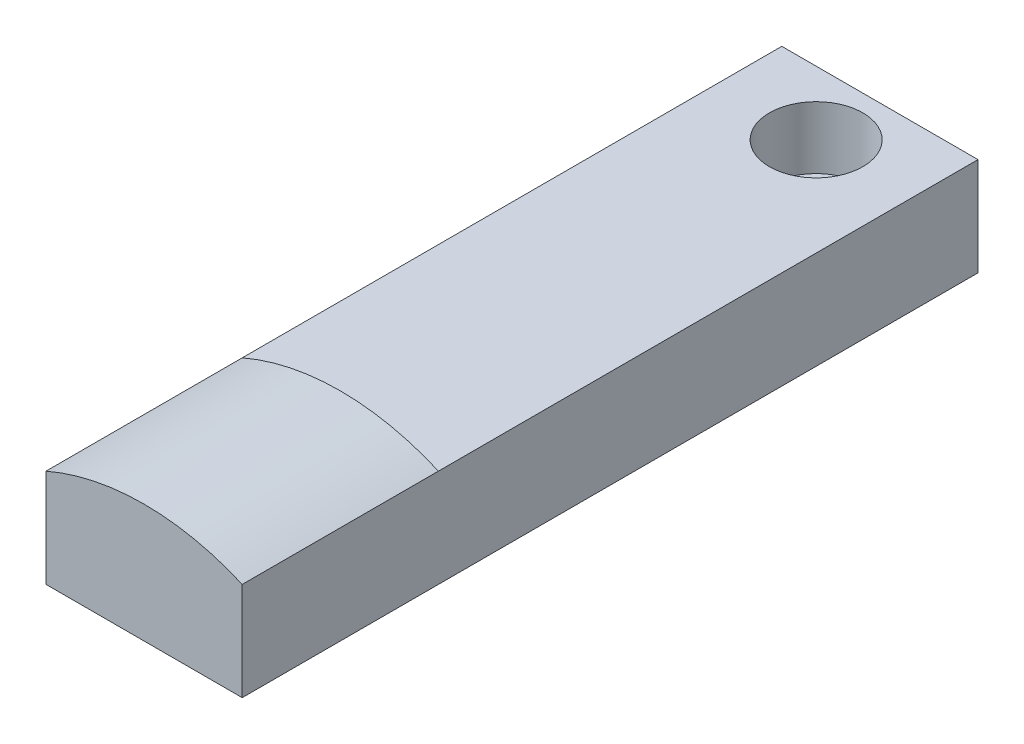
ISO-10303-21;
HEADER;
FILE_DESCRIPTION(('STEP AP214'),'2;1');
FILE_NAME('part.step','',(''),(''),'','','');
FILE_SCHEMA(('AUTOMOTIVE_DESIGN { 1 0 10303 214 1 1 1 1 }'));
ENDSEC;
DATA;
#1=APPLICATION_CONTEXT('core data for automotive mechanical design processes');
#2=APPLICATION_PROTOCOL_DEFINITION('international standard','automotive_design',2000,#1);
#3=PRODUCT_CONTEXT('',#1,'mechanical');
#4=PRODUCT('Part','Part','',(#3));
#5=PRODUCT_RELATED_PRODUCT_CATEGORY('part','',(#4));
#6=PRODUCT_DEFINITION_FORMATION('','',#4);
#7=PRODUCT_DEFINITION_CONTEXT('part definition',#1,'design');
#8=PRODUCT_DEFINITION('design','',#6,#7);
#9=PRODUCT_DEFINITION_SHAPE('','',#8);
#10=(LENGTH_UNIT() NAMED_UNIT(*) SI_UNIT(.MILLI.,.METRE.));
#11=(NAMED_UNIT(*) PLANE_ANGLE_UNIT() SI_UNIT($,.RADIAN.));
#12=(NAMED_UNIT(*) SI_UNIT($,.STERADIAN.) SOLID_ANGLE_UNIT());
#13=UNCERTAINTY_MEASURE_WITH_UNIT(LENGTH_MEASURE(1.E-05),#10,'distance_accuracy_value','');
#14=(GEOMETRIC_REPRESENTATION_CONTEXT(3) GLOBAL_UNCERTAINTY_ASSIGNED_CONTEXT((#13)) GLOBAL_UNIT_ASSIGNED_CONTEXT((#10,
#11,#12)) REPRESENTATION_CONTEXT('',''));
#15=CARTESIAN_POINT('',(0.,0.,0.));
#16=DIRECTION('',(0.,0.,1.));
#17=DIRECTION('',(1.,0.,0.));
#18=AXIS2_PLACEMENT_3D('',#15,#16,#17);
#19=CARTESIAN_POINT('',(10.,5.,75.));
#20=DIRECTION('',(0.,-1.,0.));
#21=DIRECTION('',(1.,0.,0.));
#22=AXIS2_PLACEMENT_3D('',#19,#20,#21);
#23=PLANE('',#22);
#24=CARTESIAN_POINT('',(0.,5.,6.5));
#25=DIRECTION('',(0.,1.,0.));
#26=DIRECTION('',(0.,0.,1.));
#27=AXIS2_PLACEMENT_3D('',#24,#25,#26);
#28=CIRCLE('',#27,4.76000000000001);
#29=CARTESIAN_POINT('',(0.,5.,11.26));
#30=VERTEX_POINT('',#29);
#31=EDGE_CURVE('E102',#30,#30,#28,.T.);
#32=ORIENTED_EDGE('',*,*,#31,.F.);
#33=EDGE_LOOP('',(#32));
#34=FACE_BOUND('',#33,.T.);
#35=DIRECTION('',(1.,0.,0.));
#36=VECTOR('',#35,1.);
#37=CARTESIAN_POINT('',(-10.,5.,55.));
#38=LINE('',#37,#36);
#39=CARTESIAN_POINT('',(-10.,5.,55.));
#40=VERTEX_POINT('',#39);
#41=CARTESIAN_POINT('',(10.,5.,55.));
#42=VERTEX_POINT('',#41);
#43=EDGE_CURVE('E99',#40,#42,#38,.T.);
#44=ORIENTED_EDGE('',*,*,#43,.T.);
#45=DIRECTION('',(0.,0.,-1.));
#46=VECTOR('',#45,1.);
#47=CARTESIAN_POINT('',(10.,5.,75.));
#48=LINE('',#47,#46);
#49=CARTESIAN_POINT('',(10.,5.,0.));
#50=VERTEX_POINT('',#49);
#51=EDGE_CURVE('E70',#42,#50,#48,.T.);
#52=ORIENTED_EDGE('',*,*,#51,.T.);
#53=DIRECTION('',(-1.,0.,0.));
#54=VECTOR('',#53,1.);
#55=CARTESIAN_POINT('',(10.,5.,0.));
#56=LINE('',#55,#54);
#57=CARTESIAN_POINT('',(-10.,5.,0.));
#58=VERTEX_POINT('',#57);
#59=EDGE_CURVE('E105',#50,#58,#56,.T.);
#60=ORIENTED_EDGE('',*,*,#59,.T.);
#61=DIRECTION('',(0.,0.,-1.));
#62=VECTOR('',#61,1.);
#63=CARTESIAN_POINT('',(-10.,5.,75.));
#64=LINE('',#63,#62);
#65=EDGE_CURVE('E77',#40,#58,#64,.T.);
#66=ORIENTED_EDGE('',*,*,#65,.F.);
#67=EDGE_LOOP('',(#44,#52,#60,#66));
#68=FACE_BOUND('',#67,.T.);
#69=ADVANCED_FACE('F33',(#34,#68),#23,.F.);
#70=CARTESIAN_POINT('',(-10.,-5.,75.));
#71=DIRECTION('',(1.,0.,0.));
#72=DIRECTION('',(0.,0.,-1.));
#73=AXIS2_PLACEMENT_3D('',#70,#71,#72);
#74=PLANE('',#73);
#75=DIRECTION('',(0.,-1.,0.));
#76=VECTOR('',#75,1.);
#77=CARTESIAN_POINT('',(-10.,-5.,0.));
#78=LINE('',#77,#76);
#79=CARTESIAN_POINT('',(-10.,-5.,0.));
#80=VERTEX_POINT('',#79);
#81=EDGE_CURVE('E124',#58,#80,#78,.T.);
#82=ORIENTED_EDGE('',*,*,#81,.T.);
#83=DIRECTION('',(0.,0.,-1.));
#84=VECTOR('',#83,1.);
#85=CARTESIAN_POINT('',(-10.,-5.,75.));
#86=LINE('',#85,#84);
#87=CARTESIAN_POINT('',(-10.,-5.,75.));
#88=VERTEX_POINT('',#87);
#89=EDGE_CURVE('E11',#88,#80,#86,.T.);
#90=ORIENTED_EDGE('',*,*,#89,.F.);
#91=DIRECTION('',(0.,-1.,0.));
#92=VECTOR('',#91,1.);
#93=CARTESIAN_POINT('',(-10.,-5.,75.));
#94=LINE('',#93,#92);
#95=CARTESIAN_POINT('',(-10.,5.,75.));
#96=VERTEX_POINT('',#95);
#97=EDGE_CURVE('E110',#96,#88,#94,.T.);
#98=ORIENTED_EDGE('',*,*,#97,.F.);
#99=EDGE_CURVE('E94',#96,#40,#64,.T.);
#100=ORIENTED_EDGE('',*,*,#99,.T.);
#101=ORIENTED_EDGE('',*,*,#65,.T.);
#102=EDGE_LOOP('',(#82,#90,#98,#100,#101));
#103=FACE_BOUND('',#102,.T.);
#104=ADVANCED_FACE('F35',(#103),#74,.F.);
#105=CARTESIAN_POINT('',(10.,-5.,75.));
#106=DIRECTION('',(0.,1.,0.));
#107=DIRECTION('',(-1.,0.,0.));
#108=AXIS2_PLACEMENT_3D('',#105,#106,#107);
#109=PLANE('',#108);
#110=CARTESIAN_POINT('',(0.,-5.,6.5));
#111=DIRECTION('',(0.,1.,0.));
#112=DIRECTION('',(-1.,0.,0.));
#113=AXIS2_PLACEMENT_3D('',#110,#111,#112);
#114=CIRCLE('',#113,3.17500000000001);
#115=CARTESIAN_POINT('',(-3.17500000000001,-5.,6.5));
#116=VERTEX_POINT('',#115);
#117=EDGE_CURVE('E37',#116,#116,#114,.T.);
#118=ORIENTED_EDGE('',*,*,#117,.T.);
#119=EDGE_LOOP('',(#118));
#120=FACE_BOUND('',#119,.T.);
#121=DIRECTION('',(1.,0.,0.));
#122=VECTOR('',#121,1.);
#123=CARTESIAN_POINT('',(10.,-5.,0.));
#124=LINE('',#123,#122);
#125=CARTESIAN_POINT('',(10.,-5.,0.));
#126=VERTEX_POINT('',#125);
#127=EDGE_CURVE('E123',#80,#126,#124,.T.);
#128=ORIENTED_EDGE('',*,*,#127,.T.);
#129=DIRECTION('',(0.,0.,-1.));
#130=VECTOR('',#129,1.);
#131=CARTESIAN_POINT('',(10.,-5.,75.));
#132=LINE('',#131,#130);
#133=CARTESIAN_POINT('',(10.,-5.,75.));
#134=VERTEX_POINT('',#133);
#135=EDGE_CURVE('E43',#134,#126,#132,.T.);
#136=ORIENTED_EDGE('',*,*,#135,.F.);
#137=DIRECTION('',(1.,0.,0.));
#138=VECTOR('',#137,1.);
#139=CARTESIAN_POINT('',(10.,-5.,75.));
#140=LINE('',#139,#138);
#141=EDGE_CURVE('E81',#88,#134,#140,.T.);
#142=ORIENTED_EDGE('',*,*,#141,.F.);
#143=ORIENTED_EDGE('',*,*,#89,.T.);
#144=EDGE_LOOP('',(#128,#136,#142,#143));
#145=FACE_BOUND('',#144,.T.);
#146=ADVANCED_FACE('F148',(#120,#145),#109,.F.);
#147=CARTESIAN_POINT('',(10.,-5.,75.));
#148=DIRECTION('',(-1.,0.,0.));
#149=DIRECTION('',(0.,0.,1.));
#150=AXIS2_PLACEMENT_3D('',#147,#148,#149);
#151=PLANE('',#150);
#152=DIRECTION('',(0.,1.,0.));
#153=VECTOR('',#152,1.);
#154=CARTESIAN_POINT('',(10.,-5.,0.));
#155=LINE('',#154,#153);
#156=EDGE_CURVE('E120',#126,#50,#155,.T.);
#157=ORIENTED_EDGE('',*,*,#156,.T.);
#158=ORIENTED_EDGE('',*,*,#51,.F.);
#159=CARTESIAN_POINT('',(10.,5.,75.));
#160=VERTEX_POINT('',#159);
#161=EDGE_CURVE('E97',#160,#42,#48,.T.);
#162=ORIENTED_EDGE('',*,*,#161,.F.);
#163=DIRECTION('',(0.,1.,0.));
#164=VECTOR('',#163,1.);
#165=CARTESIAN_POINT('',(10.,-5.,75.));
#166=LINE('',#165,#164);
#167=EDGE_CURVE('E107',#134,#160,#166,.T.);
#168=ORIENTED_EDGE('',*,*,#167,.F.);
#169=ORIENTED_EDGE('',*,*,#135,.T.);
#170=EDGE_LOOP('',(#157,#158,#162,#168,#169));
#171=FACE_BOUND('',#170,.T.);
#172=ADVANCED_FACE('F119',(#171),#151,.F.);
#173=CARTESIAN_POINT('',(0.,0.,75.));
#174=DIRECTION('',(0.,0.,1.));
#175=DIRECTION('',(1.,0.,0.));
#176=AXIS2_PLACEMENT_3D('',#173,#174,#175);
#177=PLANE('',#176);
#178=ORIENTED_EDGE('',*,*,#97,.T.);
#179=ORIENTED_EDGE('',*,*,#141,.T.);
#180=ORIENTED_EDGE('',*,*,#167,.T.);
#181=CARTESIAN_POINT('',(0.,-17.9128784747792,75.));
#182=DIRECTION('',(0.,0.,1.));
#183=DIRECTION('',(1.,0.,0.));
#184=AXIS2_PLACEMENT_3D('',#181,#182,#183);
#185=CIRCLE('',#184,25.);
#186=EDGE_CURVE('E51',#160,#96,#185,.T.);
#187=ORIENTED_EDGE('',*,*,#186,.T.);
#188=EDGE_LOOP('',(#178,#179,#180,#187));
#189=FACE_BOUND('',#188,.T.);
#190=ADVANCED_FACE('F153',(#189),#177,.T.);
#191=CARTESIAN_POINT('',(0.,0.,0.));
#192=DIRECTION('',(0.,0.,1.));
#193=DIRECTION('',(1.,0.,0.));
#194=AXIS2_PLACEMENT_3D('',#191,#192,#193);
#195=PLANE('',#194);
#196=ORIENTED_EDGE('',*,*,#81,.F.);
#197=ORIENTED_EDGE('',*,*,#59,.F.);
#198=ORIENTED_EDGE('',*,*,#156,.F.);
#199=ORIENTED_EDGE('',*,*,#127,.F.);
#200=EDGE_LOOP('',(#196,#197,#198,#199));
#201=FACE_BOUND('',#200,.T.);
#202=ADVANCED_FACE('F122',(#201),#195,.F.);
#203=CARTESIAN_POINT('',(0.,5.,6.5));
#204=DIRECTION('',(0.,1.,0.));
#205=DIRECTION('',(0.,0.,1.));
#206=AXIS2_PLACEMENT_3D('',#203,#204,#205);
#207=CYLINDRICAL_SURFACE('',#206,3.17500000000001);
#208=CARTESIAN_POINT('',(0.,-1.35,6.5));
#209=DIRECTION('',(0.,1.,0.));
#210=DIRECTION('',(0.,0.,1.));
#211=AXIS2_PLACEMENT_3D('',#208,#209,#210);
#212=CIRCLE('',#211,3.17500000000001);
#213=CARTESIAN_POINT('',(0.,-1.35,9.67500000000001));
#214=VERTEX_POINT('',#213);
#215=EDGE_CURVE('E131',#214,#214,#212,.T.);
#216=ORIENTED_EDGE('',*,*,#215,.T.);
#217=EDGE_LOOP('',(#216));
#218=FACE_BOUND('',#217,.T.);
#219=ORIENTED_EDGE('',*,*,#117,.F.);
#220=EDGE_LOOP('',(#219));
#221=FACE_BOUND('',#220,.T.);
#222=ADVANCED_FACE('F161',(#218,#221),#207,.F.);
#223=CARTESIAN_POINT('',(3.17500000000001,-1.35,6.5));
#224=DIRECTION('',(0.,-1.,0.));
#225=DIRECTION('',(0.,0.,-1.));
#226=AXIS2_PLACEMENT_3D('',#223,#224,#225);
#227=PLANE('',#226);
#228=ORIENTED_EDGE('',*,*,#215,.F.);
#229=EDGE_LOOP('',(#228));
#230=FACE_BOUND('',#229,.T.);
#231=CARTESIAN_POINT('',(0.,-1.35,6.5));
#232=DIRECTION('',(0.,1.,0.));
#233=DIRECTION('',(0.,0.,1.));
#234=AXIS2_PLACEMENT_3D('',#231,#232,#233);
#235=CIRCLE('',#234,4.76000000000001);
#236=CARTESIAN_POINT('',(0.,-1.35,11.26));
#237=VERTEX_POINT('',#236);
#238=EDGE_CURVE('E134',#237,#237,#235,.T.);
#239=ORIENTED_EDGE('',*,*,#238,.T.);
#240=EDGE_LOOP('',(#239));
#241=FACE_BOUND('',#240,.T.);
#242=ADVANCED_FACE('F163',(#230,#241),#227,.F.);
#243=CARTESIAN_POINT('',(0.,5.,6.5));
#244=DIRECTION('',(0.,1.,0.));
#245=DIRECTION('',(0.,0.,1.));
#246=AXIS2_PLACEMENT_3D('',#243,#244,#245);
#247=CYLINDRICAL_SURFACE('',#246,4.76000000000001);
#248=ORIENTED_EDGE('',*,*,#238,.F.);
#249=EDGE_LOOP('',(#248));
#250=FACE_BOUND('',#249,.T.);
#251=ORIENTED_EDGE('',*,*,#31,.T.);
#252=EDGE_LOOP('',(#251));
#253=FACE_BOUND('',#252,.T.);
#254=ADVANCED_FACE('F141',(#250,#253),#247,.F.);
#255=CARTESIAN_POINT('',(0.,-17.9128784747792,55.));
#256=DIRECTION('',(0.,0.,1.));
#257=DIRECTION('',(1.,0.,0.));
#258=AXIS2_PLACEMENT_3D('',#255,#256,#257);
#259=CYLINDRICAL_SURFACE('',#258,25.);
#260=ORIENTED_EDGE('',*,*,#186,.F.);
#261=ORIENTED_EDGE('',*,*,#161,.T.);
#262=CARTESIAN_POINT('',(0.,-17.9128784747792,55.));
#263=DIRECTION('',(0.,0.,1.));
#264=DIRECTION('',(1.,0.,0.));
#265=AXIS2_PLACEMENT_3D('',#262,#263,#264);
#266=CIRCLE('',#265,25.);
#267=EDGE_CURVE('E91',#42,#40,#266,.T.);
#268=ORIENTED_EDGE('',*,*,#267,.T.);
#269=ORIENTED_EDGE('',*,*,#99,.F.);
#270=EDGE_LOOP('',(#260,#261,#268,#269));
#271=FACE_BOUND('',#270,.T.);
#272=ADVANCED_FACE('F93',(#271),#259,.T.);
#273=CARTESIAN_POINT('',(0.,-17.9128784747792,55.));
#274=DIRECTION('',(0.,0.,1.));
#275=DIRECTION('',(1.,0.,0.));
#276=AXIS2_PLACEMENT_3D('',#273,#274,#275);
#277=PLANE('',#276);
#278=ORIENTED_EDGE('',*,*,#267,.F.);
#279=ORIENTED_EDGE('',*,*,#43,.F.);
#280=EDGE_LOOP('',(#278,#279));
#281=FACE_BOUND('',#280,.T.);
#282=ADVANCED_FACE('F101',(#281),#277,.F.);
#283=CLOSED_SHELL('',(#69,#104,#146,#172,#190,#202,#222,#242,#254,#272,#282));
#284=MANIFOLD_SOLID_BREP('B2',#283);
#285=ADVANCED_BREP_SHAPE_REPRESENTATION('',(#18,#284),#14);
#286=SHAPE_DEFINITION_REPRESENTATION(#9,#285);
ENDSEC;
END-ISO-10303-21;
